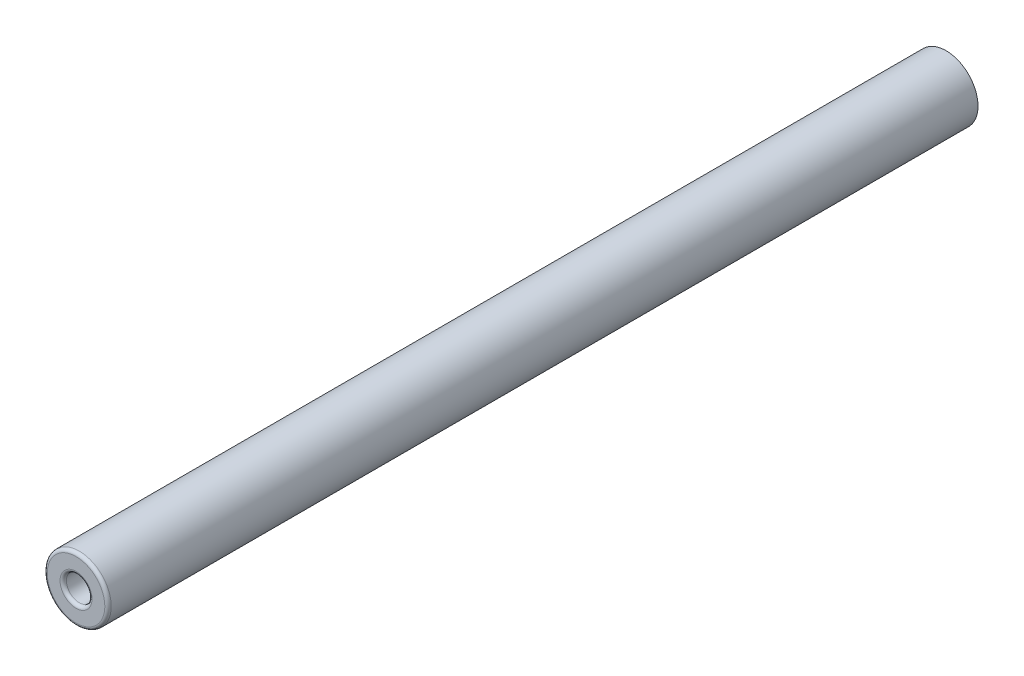
ISO-10303-21;
HEADER;
FILE_DESCRIPTION(('STEP AP214'),'2;1');
FILE_NAME('part.step','',(''),(''),'','','');
FILE_SCHEMA(('AUTOMOTIVE_DESIGN { 1 0 10303 214 1 1 1 1 }'));
ENDSEC;
DATA;
#1=APPLICATION_CONTEXT('core data for automotive mechanical design processes');
#2=APPLICATION_PROTOCOL_DEFINITION('international standard','automotive_design',2000,#1);
#3=PRODUCT_CONTEXT('',#1,'mechanical');
#4=PRODUCT('Part','Part','',(#3));
#5=PRODUCT_RELATED_PRODUCT_CATEGORY('part','',(#4));
#6=PRODUCT_DEFINITION_FORMATION('','',#4);
#7=PRODUCT_DEFINITION_CONTEXT('part definition',#1,'design');
#8=PRODUCT_DEFINITION('design','',#6,#7);
#9=PRODUCT_DEFINITION_SHAPE('','',#8);
#10=(LENGTH_UNIT() NAMED_UNIT(*) SI_UNIT(.MILLI.,.METRE.));
#11=(NAMED_UNIT(*) PLANE_ANGLE_UNIT() SI_UNIT($,.RADIAN.));
#12=(NAMED_UNIT(*) SI_UNIT($,.STERADIAN.) SOLID_ANGLE_UNIT());
#13=UNCERTAINTY_MEASURE_WITH_UNIT(LENGTH_MEASURE(1.E-05),#10,'distance_accuracy_value','');
#14=(GEOMETRIC_REPRESENTATION_CONTEXT(3) GLOBAL_UNCERTAINTY_ASSIGNED_CONTEXT((#13)) GLOBAL_UNIT_ASSIGNED_CONTEXT((#10,
#11,#12)) REPRESENTATION_CONTEXT('',''));
#15=CARTESIAN_POINT('',(0.,0.,0.));
#16=DIRECTION('',(0.,0.,1.));
#17=DIRECTION('',(1.,0.,0.));
#18=AXIS2_PLACEMENT_3D('',#15,#16,#17);
#19=CARTESIAN_POINT('',(0.,0.,34.));
#20=DIRECTION('',(0.,0.,-1.));
#21=DIRECTION('',(-1.,0.,0.));
#22=AXIS2_PLACEMENT_3D('',#19,#20,#21);
#23=CYLINDRICAL_SURFACE('',#22,2.5);
#24=CARTESIAN_POINT('',(0.,0.,33.75));
#25=DIRECTION('',(0.,0.,1.));
#26=DIRECTION('',(1.,0.,0.));
#27=AXIS2_PLACEMENT_3D('',#24,#25,#26);
#28=CIRCLE('',#27,2.5);
#29=CARTESIAN_POINT('',(2.5,0.,33.75));
#30=VERTEX_POINT('',#29);
#31=EDGE_CURVE('E37',#30,#30,#28,.F.);
#32=ORIENTED_EDGE('',*,*,#31,.T.);
#33=EDGE_LOOP('',(#32));
#34=FACE_BOUND('',#33,.T.);
#35=CARTESIAN_POINT('',(0.,0.,-34.));
#36=DIRECTION('',(0.,0.,1.));
#37=DIRECTION('',(1.,0.,0.));
#38=AXIS2_PLACEMENT_3D('',#35,#36,#37);
#39=CIRCLE('',#38,2.5);
#40=CARTESIAN_POINT('',(2.5,0.,-34.));
#41=VERTEX_POINT('',#40);
#42=EDGE_CURVE('E50',#41,#41,#39,.T.);
#43=ORIENTED_EDGE('',*,*,#42,.T.);
#44=EDGE_LOOP('',(#43));
#45=FACE_BOUND('',#44,.T.);
#46=ADVANCED_FACE('F30',(#34,#45),#23,.T.);
#47=CARTESIAN_POINT('',(0.,0.,34.));
#48=DIRECTION('',(0.,0.,1.));
#49=DIRECTION('',(1.,0.,0.));
#50=AXIS2_PLACEMENT_3D('',#47,#48,#49);
#51=PLANE('',#50);
#52=CARTESIAN_POINT('',(0.,0.,34.));
#53=DIRECTION('',(0.,0.,1.));
#54=DIRECTION('',(1.,0.,0.));
#55=AXIS2_PLACEMENT_3D('',#52,#53,#54);
#56=CIRCLE('',#55,2.25);
#57=CARTESIAN_POINT('',(2.25,0.,34.));
#58=VERTEX_POINT('',#57);
#59=EDGE_CURVE('E41',#58,#58,#56,.T.);
#60=ORIENTED_EDGE('',*,*,#59,.T.);
#61=EDGE_LOOP('',(#60));
#62=FACE_BOUND('',#61,.T.);
#63=CARTESIAN_POINT('',(0.,0.,34.));
#64=DIRECTION('',(0.,0.,1.));
#65=DIRECTION('',(1.,0.,0.));
#66=AXIS2_PLACEMENT_3D('',#63,#64,#65);
#67=CIRCLE('',#66,1.25);
#68=CARTESIAN_POINT('',(1.25,0.,34.));
#69=VERTEX_POINT('',#68);
#70=EDGE_CURVE('E45',#69,#69,#67,.F.);
#71=ORIENTED_EDGE('',*,*,#70,.T.);
#72=EDGE_LOOP('',(#71));
#73=FACE_BOUND('',#72,.T.);
#74=ADVANCED_FACE('F69',(#62,#73),#51,.T.);
#75=CARTESIAN_POINT('',(0.,0.,-34.));
#76=DIRECTION('',(0.,0.,1.));
#77=DIRECTION('',(1.,0.,0.));
#78=AXIS2_PLACEMENT_3D('',#75,#76,#77);
#79=PLANE('',#78);
#80=ORIENTED_EDGE('',*,*,#42,.F.);
#81=EDGE_LOOP('',(#80));
#82=FACE_BOUND('',#81,.T.);
#83=ADVANCED_FACE('F61',(#82),#79,.F.);
#84=CARTESIAN_POINT('',(0.,0.,14.));
#85=DIRECTION('',(0.,0.,1.));
#86=DIRECTION('',(1.,0.,0.));
#87=AXIS2_PLACEMENT_3D('',#84,#85,#86);
#88=CYLINDRICAL_SURFACE('',#87,1.);
#89=CARTESIAN_POINT('',(0.,0.,33.75));
#90=DIRECTION('',(0.,0.,1.));
#91=DIRECTION('',(1.,0.,0.));
#92=AXIS2_PLACEMENT_3D('',#89,#90,#91);
#93=CIRCLE('',#92,1.);
#94=CARTESIAN_POINT('',(1.,0.,33.75));
#95=VERTEX_POINT('',#94);
#96=EDGE_CURVE('E10',#95,#95,#93,.T.);
#97=ORIENTED_EDGE('',*,*,#96,.T.);
#98=EDGE_LOOP('',(#97));
#99=FACE_BOUND('',#98,.T.);
#100=CARTESIAN_POINT('',(0.,0.,14.));
#101=DIRECTION('',(0.,0.,1.));
#102=DIRECTION('',(1.,0.,0.));
#103=AXIS2_PLACEMENT_3D('',#100,#101,#102);
#104=CIRCLE('',#103,1.);
#105=CARTESIAN_POINT('',(1.,0.,14.));
#106=VERTEX_POINT('',#105);
#107=EDGE_CURVE('E53',#106,#106,#104,.T.);
#108=ORIENTED_EDGE('',*,*,#107,.F.);
#109=EDGE_LOOP('',(#108));
#110=FACE_BOUND('',#109,.T.);
#111=ADVANCED_FACE('F59',(#99,#110),#88,.F.);
#112=CARTESIAN_POINT('',(0.,0.,14.));
#113=DIRECTION('',(0.,0.,1.));
#114=DIRECTION('',(1.,0.,0.));
#115=AXIS2_PLACEMENT_3D('',#112,#113,#114);
#116=PLANE('',#115);
#117=ORIENTED_EDGE('',*,*,#107,.T.);
#118=EDGE_LOOP('',(#117));
#119=FACE_BOUND('',#118,.T.);
#120=ADVANCED_FACE('F57',(#119),#116,.T.);
#121=CARTESIAN_POINT('',(0.,0.,33.75));
#122=DIRECTION('',(0.,0.,1.));
#123=DIRECTION('',(1.,0.,0.));
#124=AXIS2_PLACEMENT_3D('',#121,#122,#123);
#125=TOROIDAL_SURFACE('',#124,2.25,0.25);
#126=ORIENTED_EDGE('',*,*,#31,.F.);
#127=EDGE_LOOP('',(#126));
#128=FACE_BOUND('',#127,.T.);
#129=ORIENTED_EDGE('',*,*,#59,.F.);
#130=EDGE_LOOP('',(#129));
#131=FACE_BOUND('',#130,.T.);
#132=ADVANCED_FACE('F67',(#128,#131),#125,.T.);
#133=CARTESIAN_POINT('',(0.,0.,33.75));
#134=DIRECTION('',(0.,0.,1.));
#135=DIRECTION('',(1.,0.,0.));
#136=AXIS2_PLACEMENT_3D('',#133,#134,#135);
#137=TOROIDAL_SURFACE('',#136,1.25,0.25);
#138=ORIENTED_EDGE('',*,*,#70,.F.);
#139=EDGE_LOOP('',(#138));
#140=FACE_BOUND('',#139,.T.);
#141=ORIENTED_EDGE('',*,*,#96,.F.);
#142=EDGE_LOOP('',(#141));
#143=FACE_BOUND('',#142,.T.);
#144=ADVANCED_FACE('F32',(#140,#143),#137,.T.);
#145=CLOSED_SHELL('',(#46,#74,#83,#111,#120,#132,#144));
#146=MANIFOLD_SOLID_BREP('B2',#145);
#147=ADVANCED_BREP_SHAPE_REPRESENTATION('',(#18,#146),#14);
#148=SHAPE_DEFINITION_REPRESENTATION(#9,#147);
ENDSEC;
END-ISO-10303-21;
